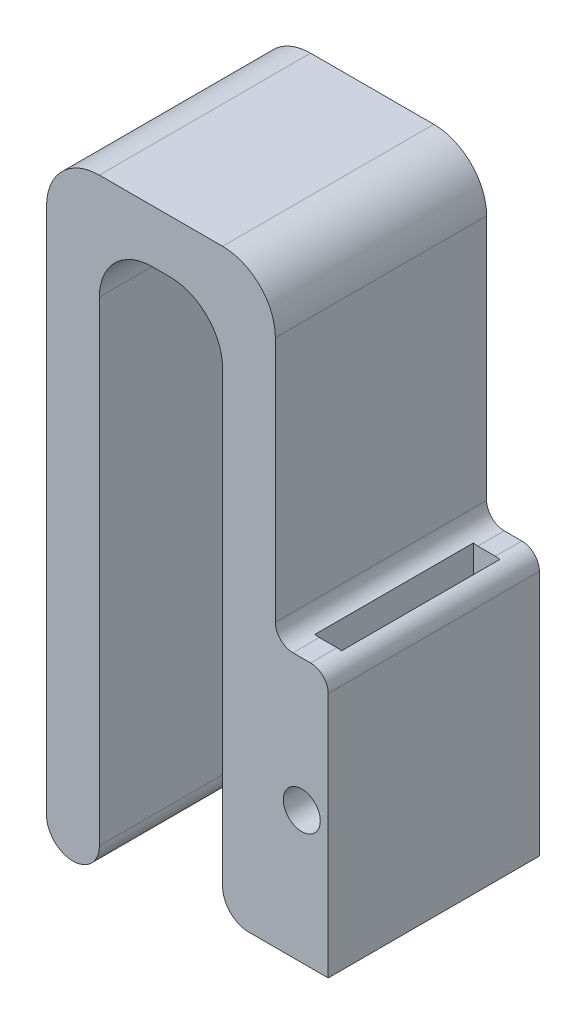
ISO-10303-21;
HEADER;
FILE_DESCRIPTION(('STEP AP214'),'2;1');
FILE_NAME('part.step','',(''),(''),'','','');
FILE_SCHEMA(('AUTOMOTIVE_DESIGN { 1 0 10303 214 1 1 1 1 }'));
ENDSEC;
DATA;
#1=APPLICATION_CONTEXT('core data for automotive mechanical design processes');
#2=APPLICATION_PROTOCOL_DEFINITION('international standard','automotive_design',2000,#1);
#3=PRODUCT_CONTEXT('',#1,'mechanical');
#4=PRODUCT('Part','Part','',(#3));
#5=PRODUCT_RELATED_PRODUCT_CATEGORY('part','',(#4));
#6=PRODUCT_DEFINITION_FORMATION('','',#4);
#7=PRODUCT_DEFINITION_CONTEXT('part definition',#1,'design');
#8=PRODUCT_DEFINITION('design','',#6,#7);
#9=PRODUCT_DEFINITION_SHAPE('','',#8);
#10=(LENGTH_UNIT() NAMED_UNIT(*) SI_UNIT(.MILLI.,.METRE.));
#11=(NAMED_UNIT(*) PLANE_ANGLE_UNIT() SI_UNIT($,.RADIAN.));
#12=(NAMED_UNIT(*) SI_UNIT($,.STERADIAN.) SOLID_ANGLE_UNIT());
#13=UNCERTAINTY_MEASURE_WITH_UNIT(LENGTH_MEASURE(1.E-05),#10,'distance_accuracy_value','');
#14=(GEOMETRIC_REPRESENTATION_CONTEXT(3) GLOBAL_UNCERTAINTY_ASSIGNED_CONTEXT((#13)) GLOBAL_UNIT_ASSIGNED_CONTEXT((#10,
#11,#12)) REPRESENTATION_CONTEXT('',''));
#15=CARTESIAN_POINT('',(0.,0.,0.));
#16=DIRECTION('',(0.,0.,1.));
#17=DIRECTION('',(1.,0.,0.));
#18=AXIS2_PLACEMENT_3D('',#15,#16,#17);
#19=CARTESIAN_POINT('',(0.,15.,12.));
#20=DIRECTION('',(0.,1.,0.));
#21=DIRECTION('',(0.,0.,1.));
#22=AXIS2_PLACEMENT_3D('',#19,#20,#21);
#23=PLANE('',#22);
#24=DIRECTION('',(1.,0.,0.));
#25=VECTOR('',#24,1.);
#26=CARTESIAN_POINT('',(0.,15.,12.));
#27=LINE('',#26,#25);
#28=CARTESIAN_POINT('',(4.,15.,12.));
#29=VERTEX_POINT('',#28);
#30=CARTESIAN_POINT('',(5.,15.,12.));
#31=VERTEX_POINT('',#30);
#32=EDGE_CURVE('E314',#29,#31,#27,.T.);
#33=ORIENTED_EDGE('',*,*,#32,.T.);
#34=DIRECTION('',(0.,0.,-1.));
#35=VECTOR('',#34,1.);
#36=CARTESIAN_POINT('',(5.,15.,0.));
#37=LINE('',#36,#35);
#38=CARTESIAN_POINT('',(5.,15.,10.5));
#39=VERTEX_POINT('',#38);
#40=EDGE_CURVE('E443',#31,#39,#37,.T.);
#41=ORIENTED_EDGE('',*,*,#40,.T.);
#42=DIRECTION('',(1.,0.,0.));
#43=VECTOR('',#42,1.);
#44=CARTESIAN_POINT('',(3.75,15.,10.5));
#45=LINE('',#44,#43);
#46=CARTESIAN_POINT('',(4.,15.,10.5));
#47=VERTEX_POINT('',#46);
#48=EDGE_CURVE('E263',#47,#39,#45,.T.);
#49=ORIENTED_EDGE('',*,*,#48,.F.);
#50=DIRECTION('',(0.,0.,-1.));
#51=VECTOR('',#50,1.);
#52=CARTESIAN_POINT('',(4.,15.,12.));
#53=LINE('',#52,#51);
#54=EDGE_CURVE('E434',#47,#29,#53,.F.);
#55=ORIENTED_EDGE('',*,*,#54,.T.);
#56=EDGE_LOOP('',(#33,#41,#49,#55));
#57=FACE_BOUND('',#56,.T.);
#58=ADVANCED_FACE('F45',(#57),#23,.T.);
#59=CARTESIAN_POINT('',(5.25,-1.5,1.5));
#60=DIRECTION('',(1.,0.,0.));
#61=DIRECTION('',(0.,0.,-1.));
#62=AXIS2_PLACEMENT_3D('',#59,#60,#61);
#63=PLANE('',#62);
#64=DIRECTION('',(0.,1.,0.));
#65=VECTOR('',#64,1.);
#66=CARTESIAN_POINT('',(5.25,-1.5,10.5));
#67=LINE('',#66,#65);
#68=CARTESIAN_POINT('',(5.25,8.23484692283495,10.5));
#69=VERTEX_POINT('',#68);
#70=CARTESIAN_POINT('',(5.25,14.9682458365519,10.5));
#71=VERTEX_POINT('',#70);
#72=EDGE_CURVE('E563',#69,#71,#67,.T.);
#73=ORIENTED_EDGE('',*,*,#72,.T.);
#74=DIRECTION('',(0.,0.,1.));
#75=VECTOR('',#74,1.);
#76=CARTESIAN_POINT('',(5.25,14.9682458365519,10.5));
#77=LINE('',#76,#75);
#78=CARTESIAN_POINT('',(5.25,14.9682458365519,1.5));
#79=VERTEX_POINT('',#78);
#80=EDGE_CURVE('E450',#71,#79,#77,.F.);
#81=ORIENTED_EDGE('',*,*,#80,.T.);
#82=DIRECTION('',(0.,1.,0.));
#83=VECTOR('',#82,1.);
#84=CARTESIAN_POINT('',(5.25,-1.5,1.5));
#85=LINE('',#84,#83);
#86=CARTESIAN_POINT('',(5.25,8.23484692283496,1.5));
#87=VERTEX_POINT('',#86);
#88=EDGE_CURVE('E256',#87,#79,#85,.T.);
#89=ORIENTED_EDGE('',*,*,#88,.F.);
#90=DIRECTION('',(0.,0.,1.));
#91=VECTOR('',#90,1.);
#92=CARTESIAN_POINT('',(5.25,8.23484692283496,0.));
#93=LINE('',#92,#91);
#94=EDGE_CURVE('E568',#87,#69,#93,.T.);
#95=ORIENTED_EDGE('',*,*,#94,.T.);
#96=EDGE_LOOP('',(#73,#81,#89,#95));
#97=FACE_BOUND('',#96,.T.);
#98=ADVANCED_FACE('F566',(#97),#63,.F.);
#99=CARTESIAN_POINT('',(3.75,-1.5,10.5));
#100=DIRECTION('',(0.,0.,1.));
#101=DIRECTION('',(1.,0.,0.));
#102=AXIS2_PLACEMENT_3D('',#99,#100,#101);
#103=PLANE('',#102);
#104=ORIENTED_EDGE('',*,*,#48,.T.);
#105=CARTESIAN_POINT('',(5.,14.,10.5));
#106=DIRECTION('',(0.,0.,1.));
#107=DIRECTION('',(1.,0.,0.));
#108=AXIS2_PLACEMENT_3D('',#105,#106,#107);
#109=CIRCLE('',#108,1.);
#110=EDGE_CURVE('E447',#39,#71,#109,.F.);
#111=ORIENTED_EDGE('',*,*,#110,.T.);
#112=ORIENTED_EDGE('',*,*,#72,.F.);
#113=CARTESIAN_POINT('',(4.5,7.5,10.5));
#114=DIRECTION('',(0.,0.,1.));
#115=DIRECTION('',(1.,0.,0.));
#116=AXIS2_PLACEMENT_3D('',#113,#114,#115);
#117=CIRCLE('',#116,1.05);
#118=CARTESIAN_POINT('',(3.75,8.23484692283495,10.5));
#119=VERTEX_POINT('',#118);
#120=EDGE_CURVE('E581',#69,#119,#117,.T.);
#121=ORIENTED_EDGE('',*,*,#120,.T.);
#122=DIRECTION('',(0.,1.,0.));
#123=VECTOR('',#122,1.);
#124=CARTESIAN_POINT('',(3.75,-1.5,10.5));
#125=LINE('',#124,#123);
#126=CARTESIAN_POINT('',(3.75,15.0317541634481,10.5));
#127=VERTEX_POINT('',#126);
#128=EDGE_CURVE('E61',#119,#127,#125,.T.);
#129=ORIENTED_EDGE('',*,*,#128,.T.);
#130=CARTESIAN_POINT('',(4.,16.,10.5));
#131=DIRECTION('',(0.,0.,1.));
#132=DIRECTION('',(1.,0.,0.));
#133=AXIS2_PLACEMENT_3D('',#130,#131,#132);
#134=CIRCLE('',#133,1.);
#135=EDGE_CURVE('E54',#127,#47,#134,.T.);
#136=ORIENTED_EDGE('',*,*,#135,.T.);
#137=EDGE_LOOP('',(#104,#111,#112,#121,#129,#136));
#138=FACE_BOUND('',#137,.T.);
#139=ADVANCED_FACE('F481',(#138),#103,.F.);
#140=CARTESIAN_POINT('',(3.75,-1.5,1.5));
#141=DIRECTION('',(-1.,0.,0.));
#142=DIRECTION('',(0.,0.,1.));
#143=AXIS2_PLACEMENT_3D('',#140,#141,#142);
#144=PLANE('',#143);
#145=DIRECTION('',(0.,1.,0.));
#146=VECTOR('',#145,1.);
#147=CARTESIAN_POINT('',(3.75,-1.5,1.5));
#148=LINE('',#147,#146);
#149=CARTESIAN_POINT('',(3.75,0.,1.5));
#150=VERTEX_POINT('',#149);
#151=CARTESIAN_POINT('',(3.75,6.76515307716505,1.5));
#152=VERTEX_POINT('',#151);
#153=EDGE_CURVE('E260',#150,#152,#148,.T.);
#154=ORIENTED_EDGE('',*,*,#153,.T.);
#155=DIRECTION('',(0.,0.,1.));
#156=VECTOR('',#155,1.);
#157=CARTESIAN_POINT('',(3.75,6.76515307716505,0.));
#158=LINE('',#157,#156);
#159=CARTESIAN_POINT('',(3.75,6.76515307716505,10.5));
#160=VERTEX_POINT('',#159);
#161=EDGE_CURVE('E232',#152,#160,#158,.T.);
#162=ORIENTED_EDGE('',*,*,#161,.T.);
#163=CARTESIAN_POINT('',(3.75,0.,10.5));
#164=VERTEX_POINT('',#163);
#165=EDGE_CURVE('E570',#164,#160,#125,.T.);
#166=ORIENTED_EDGE('',*,*,#165,.F.);
#167=DIRECTION('',(0.,0.,1.));
#168=VECTOR('',#167,1.);
#169=CARTESIAN_POINT('',(3.75,0.,12.));
#170=LINE('',#169,#168);
#171=EDGE_CURVE('E268',#150,#164,#170,.T.);
#172=ORIENTED_EDGE('',*,*,#171,.F.);
#173=EDGE_LOOP('',(#154,#162,#166,#172));
#174=FACE_BOUND('',#173,.T.);
#175=ADVANCED_FACE('F641',(#174),#144,.F.);
#176=CARTESIAN_POINT('',(3.75,-1.5,1.5));
#177=DIRECTION('',(0.,0.,-1.));
#178=DIRECTION('',(-1.,0.,0.));
#179=AXIS2_PLACEMENT_3D('',#176,#177,#178);
#180=PLANE('',#179);
#181=ORIENTED_EDGE('',*,*,#88,.T.);
#182=CARTESIAN_POINT('',(5.,14.,1.5));
#183=DIRECTION('',(0.,0.,-1.));
#184=DIRECTION('',(-1.,0.,0.));
#185=AXIS2_PLACEMENT_3D('',#182,#183,#184);
#186=CIRCLE('',#185,1.);
#187=CARTESIAN_POINT('',(5.,15.,1.5));
#188=VERTEX_POINT('',#187);
#189=EDGE_CURVE('E453',#79,#188,#186,.F.);
#190=ORIENTED_EDGE('',*,*,#189,.T.);
#191=DIRECTION('',(-1.,0.,0.));
#192=VECTOR('',#191,1.);
#193=CARTESIAN_POINT('',(3.75,15.,1.5));
#194=LINE('',#193,#192);
#195=CARTESIAN_POINT('',(4.,15.,1.5));
#196=VERTEX_POINT('',#195);
#197=EDGE_CURVE('E489',#188,#196,#194,.T.);
#198=ORIENTED_EDGE('',*,*,#197,.T.);
#199=CARTESIAN_POINT('',(4.,16.,1.5));
#200=DIRECTION('',(0.,0.,-1.));
#201=DIRECTION('',(-1.,0.,0.));
#202=AXIS2_PLACEMENT_3D('',#199,#200,#201);
#203=CIRCLE('',#202,1.);
#204=CARTESIAN_POINT('',(3.75,15.0317541634481,1.5));
#205=VERTEX_POINT('',#204);
#206=EDGE_CURVE('E472',#196,#205,#203,.T.);
#207=ORIENTED_EDGE('',*,*,#206,.T.);
#208=CARTESIAN_POINT('',(3.75,8.23484692283495,1.5));
#209=VERTEX_POINT('',#208);
#210=EDGE_CURVE('E68',#209,#205,#148,.T.);
#211=ORIENTED_EDGE('',*,*,#210,.F.);
#212=CARTESIAN_POINT('',(4.5,7.5,1.5));
#213=DIRECTION('',(0.,0.,-1.));
#214=DIRECTION('',(-1.,0.,0.));
#215=AXIS2_PLACEMENT_3D('',#212,#213,#214);
#216=CIRCLE('',#215,1.05);
#217=EDGE_CURVE('E237',#209,#87,#216,.T.);
#218=ORIENTED_EDGE('',*,*,#217,.T.);
#219=EDGE_LOOP('',(#181,#190,#198,#207,#211,#218));
#220=FACE_BOUND('',#219,.T.);
#221=ADVANCED_FACE('F633',(#220),#180,.F.);
#222=CARTESIAN_POINT('',(-8.5,0.,12.));
#223=DIRECTION('',(0.,0.,-1.));
#224=DIRECTION('',(-1.,0.,0.));
#225=AXIS2_PLACEMENT_3D('',#222,#223,#224);
#226=CYLINDRICAL_SURFACE('',#225,1.5);
#227=CARTESIAN_POINT('',(-8.5,0.,0.));
#228=DIRECTION('',(0.,0.,1.));
#229=DIRECTION('',(1.,0.,0.));
#230=AXIS2_PLACEMENT_3D('',#227,#228,#229);
#231=CIRCLE('',#230,1.5);
#232=CARTESIAN_POINT('',(-10.,0.,0.));
#233=VERTEX_POINT('',#232);
#234=CARTESIAN_POINT('',(-7.,0.,0.));
#235=VERTEX_POINT('',#234);
#236=EDGE_CURVE('E279',#233,#235,#231,.T.);
#237=ORIENTED_EDGE('',*,*,#236,.T.);
#238=DIRECTION('',(0.,0.,-1.));
#239=VECTOR('',#238,1.);
#240=CARTESIAN_POINT('',(-7.,0.,12.));
#241=LINE('',#240,#239);
#242=CARTESIAN_POINT('',(-7.,0.,12.));
#243=VERTEX_POINT('',#242);
#244=EDGE_CURVE('E238',#243,#235,#241,.T.);
#245=ORIENTED_EDGE('',*,*,#244,.F.);
#246=CARTESIAN_POINT('',(-8.5,0.,12.));
#247=DIRECTION('',(0.,0.,1.));
#248=DIRECTION('',(1.,0.,0.));
#249=AXIS2_PLACEMENT_3D('',#246,#247,#248);
#250=CIRCLE('',#249,1.5);
#251=CARTESIAN_POINT('',(-10.,0.,12.));
#252=VERTEX_POINT('',#251);
#253=EDGE_CURVE('E280',#252,#243,#250,.T.);
#254=ORIENTED_EDGE('',*,*,#253,.F.);
#255=DIRECTION('',(0.,0.,-1.));
#256=VECTOR('',#255,1.);
#257=CARTESIAN_POINT('',(-10.,0.,12.));
#258=LINE('',#257,#256);
#259=EDGE_CURVE('E338',#252,#233,#258,.T.);
#260=ORIENTED_EDGE('',*,*,#259,.T.);
#261=EDGE_LOOP('',(#237,#245,#254,#260));
#262=FACE_BOUND('',#261,.T.);
#263=ADVANCED_FACE('F520',(#262),#226,.T.);
#264=CARTESIAN_POINT('',(-7.,0.,12.));
#265=DIRECTION('',(1.,0.,0.));
#266=DIRECTION('',(0.,1.,0.));
#267=AXIS2_PLACEMENT_3D('',#264,#265,#266);
#268=PLANE('',#267);
#269=DIRECTION('',(0.,-1.,0.));
#270=VECTOR('',#269,1.);
#271=CARTESIAN_POINT('',(-7.,0.,0.));
#272=LINE('',#271,#270);
#273=CARTESIAN_POINT('',(-7.,27.,0.));
#274=VERTEX_POINT('',#273);
#275=EDGE_CURVE('E342',#274,#235,#272,.T.);
#276=ORIENTED_EDGE('',*,*,#275,.F.);
#277=DIRECTION('',(0.,0.,-1.));
#278=VECTOR('',#277,1.);
#279=CARTESIAN_POINT('',(-7.,27.,12.));
#280=LINE('',#279,#278);
#281=CARTESIAN_POINT('',(-7.,27.,12.));
#282=VERTEX_POINT('',#281);
#283=EDGE_CURVE('E429',#282,#274,#280,.T.);
#284=ORIENTED_EDGE('',*,*,#283,.F.);
#285=DIRECTION('',(0.,-1.,0.));
#286=VECTOR('',#285,1.);
#287=CARTESIAN_POINT('',(-7.,0.,12.));
#288=LINE('',#287,#286);
#289=EDGE_CURVE('E283',#282,#243,#288,.T.);
#290=ORIENTED_EDGE('',*,*,#289,.T.);
#291=ORIENTED_EDGE('',*,*,#244,.T.);
#292=EDGE_LOOP('',(#276,#284,#290,#291));
#293=FACE_BOUND('',#292,.T.);
#294=ADVANCED_FACE('F794',(#293),#268,.T.);
#295=CARTESIAN_POINT('',(-4.,27.,12.));
#296=DIRECTION('',(0.,0.,-1.));
#297=DIRECTION('',(-1.,0.,0.));
#298=AXIS2_PLACEMENT_3D('',#295,#296,#297);
#299=CYLINDRICAL_SURFACE('',#298,3.);
#300=CARTESIAN_POINT('',(-4.,27.,0.));
#301=DIRECTION('',(0.,0.,1.));
#302=DIRECTION('',(1.,0.,0.));
#303=AXIS2_PLACEMENT_3D('',#300,#301,#302);
#304=CIRCLE('',#303,3.);
#305=CARTESIAN_POINT('',(-4.,30.,0.));
#306=VERTEX_POINT('',#305);
#307=EDGE_CURVE('E346',#306,#274,#304,.T.);
#308=ORIENTED_EDGE('',*,*,#307,.F.);
#309=DIRECTION('',(0.,0.,-1.));
#310=VECTOR('',#309,1.);
#311=CARTESIAN_POINT('',(-4.,30.,12.));
#312=LINE('',#311,#310);
#313=CARTESIAN_POINT('',(-4.,30.,12.));
#314=VERTEX_POINT('',#313);
#315=EDGE_CURVE('E426',#314,#306,#312,.T.);
#316=ORIENTED_EDGE('',*,*,#315,.F.);
#317=CARTESIAN_POINT('',(-4.,27.,12.));
#318=DIRECTION('',(0.,0.,1.));
#319=DIRECTION('',(1.,0.,0.));
#320=AXIS2_PLACEMENT_3D('',#317,#318,#319);
#321=CIRCLE('',#320,3.);
#322=EDGE_CURVE('E288',#314,#282,#321,.T.);
#323=ORIENTED_EDGE('',*,*,#322,.T.);
#324=ORIENTED_EDGE('',*,*,#283,.T.);
#325=EDGE_LOOP('',(#308,#316,#323,#324));
#326=FACE_BOUND('',#325,.T.);
#327=ADVANCED_FACE('F527',(#326),#299,.F.);
#328=CARTESIAN_POINT('',(-1.04083408558611E-13,30.,12.));
#329=DIRECTION('',(0.,-1.,0.));
#330=DIRECTION('',(1.,0.,0.));
#331=AXIS2_PLACEMENT_3D('',#328,#329,#330);
#332=PLANE('',#331);
#333=DIRECTION('',(-1.,0.,0.));
#334=VECTOR('',#333,1.);
#335=CARTESIAN_POINT('',(-1.04083408558611E-13,30.,0.));
#336=LINE('',#335,#334);
#337=CARTESIAN_POINT('',(-3.00000000000002,30.,0.));
#338=VERTEX_POINT('',#337);
#339=EDGE_CURVE('E350',#338,#306,#336,.T.);
#340=ORIENTED_EDGE('',*,*,#339,.F.);
#341=DIRECTION('',(0.,0.,-1.));
#342=VECTOR('',#341,1.);
#343=CARTESIAN_POINT('',(-3.00000000000002,30.,12.));
#344=LINE('',#343,#342);
#345=CARTESIAN_POINT('',(-3.00000000000002,30.,12.));
#346=VERTEX_POINT('',#345);
#347=EDGE_CURVE('E423',#346,#338,#344,.T.);
#348=ORIENTED_EDGE('',*,*,#347,.F.);
#349=DIRECTION('',(-1.,0.,0.));
#350=VECTOR('',#349,1.);
#351=CARTESIAN_POINT('',(-1.04083408558611E-13,30.,12.));
#352=LINE('',#351,#350);
#353=EDGE_CURVE('E292',#346,#314,#352,.T.);
#354=ORIENTED_EDGE('',*,*,#353,.T.);
#355=ORIENTED_EDGE('',*,*,#315,.T.);
#356=EDGE_LOOP('',(#340,#348,#354,#355));
#357=FACE_BOUND('',#356,.T.);
#358=ADVANCED_FACE('F531',(#357),#332,.T.);
#359=CARTESIAN_POINT('',(-3.,27.,12.));
#360=DIRECTION('',(0.,0.,-1.));
#361=DIRECTION('',(-1.,0.,0.));
#362=AXIS2_PLACEMENT_3D('',#359,#360,#361);
#363=CYLINDRICAL_SURFACE('',#362,3.);
#364=CARTESIAN_POINT('',(-3.,27.,0.));
#365=DIRECTION('',(0.,0.,1.));
#366=DIRECTION('',(1.,0.,0.));
#367=AXIS2_PLACEMENT_3D('',#364,#365,#366);
#368=CIRCLE('',#367,3.);
#369=CARTESIAN_POINT('',(0.,27.,0.));
#370=VERTEX_POINT('',#369);
#371=EDGE_CURVE('E354',#370,#338,#368,.T.);
#372=ORIENTED_EDGE('',*,*,#371,.F.);
#373=DIRECTION('',(0.,0.,-1.));
#374=VECTOR('',#373,1.);
#375=CARTESIAN_POINT('',(0.,27.,12.));
#376=LINE('',#375,#374);
#377=CARTESIAN_POINT('',(0.,27.,12.));
#378=VERTEX_POINT('',#377);
#379=EDGE_CURVE('E420',#378,#370,#376,.T.);
#380=ORIENTED_EDGE('',*,*,#379,.F.);
#381=CARTESIAN_POINT('',(-3.,27.,12.));
#382=DIRECTION('',(0.,0.,1.));
#383=DIRECTION('',(1.,0.,0.));
#384=AXIS2_PLACEMENT_3D('',#381,#382,#383);
#385=CIRCLE('',#384,3.);
#386=EDGE_CURVE('E296',#378,#346,#385,.T.);
#387=ORIENTED_EDGE('',*,*,#386,.T.);
#388=ORIENTED_EDGE('',*,*,#347,.T.);
#389=EDGE_LOOP('',(#372,#380,#387,#388));
#390=FACE_BOUND('',#389,.T.);
#391=ADVANCED_FACE('F536',(#390),#363,.F.);
#392=CARTESIAN_POINT('',(0.,0.,12.));
#393=DIRECTION('',(-1.,0.,0.));
#394=DIRECTION('',(0.,0.,1.));
#395=AXIS2_PLACEMENT_3D('',#392,#393,#394);
#396=PLANE('',#395);
#397=DIRECTION('',(0.,1.,0.));
#398=VECTOR('',#397,1.);
#399=CARTESIAN_POINT('',(0.,0.,0.));
#400=LINE('',#399,#398);
#401=CARTESIAN_POINT('',(0.,1.5,0.));
#402=VERTEX_POINT('',#401);
#403=EDGE_CURVE('E358',#402,#370,#400,.T.);
#404=ORIENTED_EDGE('',*,*,#403,.F.);
#405=DIRECTION('',(0.,0.,-1.));
#406=VECTOR('',#405,1.);
#407=CARTESIAN_POINT('',(0.,1.5,12.));
#408=LINE('',#407,#406);
#409=CARTESIAN_POINT('',(0.,1.5,12.));
#410=VERTEX_POINT('',#409);
#411=EDGE_CURVE('E417',#410,#402,#408,.T.);
#412=ORIENTED_EDGE('',*,*,#411,.F.);
#413=DIRECTION('',(0.,1.,0.));
#414=VECTOR('',#413,1.);
#415=CARTESIAN_POINT('',(0.,0.,12.));
#416=LINE('',#415,#414);
#417=EDGE_CURVE('E300',#410,#378,#416,.T.);
#418=ORIENTED_EDGE('',*,*,#417,.T.);
#419=ORIENTED_EDGE('',*,*,#379,.T.);
#420=EDGE_LOOP('',(#404,#412,#418,#419));
#421=FACE_BOUND('',#420,.T.);
#422=ADVANCED_FACE('F539',(#421),#396,.T.);
#423=CARTESIAN_POINT('',(1.5,1.5,12.));
#424=DIRECTION('',(0.,0.,-1.));
#425=DIRECTION('',(-1.,0.,0.));
#426=AXIS2_PLACEMENT_3D('',#423,#424,#425);
#427=CYLINDRICAL_SURFACE('',#426,1.5);
#428=CARTESIAN_POINT('',(1.5,1.5,0.));
#429=DIRECTION('',(0.,0.,1.));
#430=DIRECTION('',(1.,0.,0.));
#431=AXIS2_PLACEMENT_3D('',#428,#429,#430);
#432=CIRCLE('',#431,1.5);
#433=CARTESIAN_POINT('',(1.5,0.,0.));
#434=VERTEX_POINT('',#433);
#435=EDGE_CURVE('E362',#402,#434,#432,.T.);
#436=ORIENTED_EDGE('',*,*,#435,.T.);
#437=DIRECTION('',(0.,0.,-1.));
#438=VECTOR('',#437,1.);
#439=CARTESIAN_POINT('',(1.5,0.,12.));
#440=LINE('',#439,#438);
#441=CARTESIAN_POINT('',(1.5,0.,12.));
#442=VERTEX_POINT('',#441);
#443=EDGE_CURVE('E413',#442,#434,#440,.T.);
#444=ORIENTED_EDGE('',*,*,#443,.F.);
#445=CARTESIAN_POINT('',(1.5,1.5,12.));
#446=DIRECTION('',(0.,0.,1.));
#447=DIRECTION('',(1.,0.,0.));
#448=AXIS2_PLACEMENT_3D('',#445,#446,#447);
#449=CIRCLE('',#448,1.5);
#450=EDGE_CURVE('E304',#410,#442,#449,.T.);
#451=ORIENTED_EDGE('',*,*,#450,.F.);
#452=ORIENTED_EDGE('',*,*,#411,.T.);
#453=EDGE_LOOP('',(#436,#444,#451,#452));
#454=FACE_BOUND('',#453,.T.);
#455=ADVANCED_FACE('F545',(#454),#427,.T.);
#456=CARTESIAN_POINT('',(0.,0.,12.));
#457=DIRECTION('',(0.,1.,0.));
#458=DIRECTION('',(-1.,0.,0.));
#459=AXIS2_PLACEMENT_3D('',#456,#457,#458);
#460=PLANE('',#459);
#461=DIRECTION('',(1.,0.,0.));
#462=VECTOR('',#461,1.);
#463=CARTESIAN_POINT('',(0.,0.,10.5));
#464=LINE('',#463,#462);
#465=CARTESIAN_POINT('',(5.25,0.,10.5));
#466=VERTEX_POINT('',#465);
#467=EDGE_CURVE('E272',#164,#466,#464,.T.);
#468=ORIENTED_EDGE('',*,*,#467,.T.);
#469=DIRECTION('',(0.,0.,-1.));
#470=VECTOR('',#469,1.);
#471=CARTESIAN_POINT('',(5.25,0.,12.));
#472=LINE('',#471,#470);
#473=CARTESIAN_POINT('',(5.25,0.,1.5));
#474=VERTEX_POINT('',#473);
#475=EDGE_CURVE('E276',#466,#474,#472,.T.);
#476=ORIENTED_EDGE('',*,*,#475,.T.);
#477=DIRECTION('',(-1.,0.,0.));
#478=VECTOR('',#477,1.);
#479=CARTESIAN_POINT('',(0.,0.,1.5));
#480=LINE('',#479,#478);
#481=EDGE_CURVE('E254',#474,#150,#480,.T.);
#482=ORIENTED_EDGE('',*,*,#481,.T.);
#483=ORIENTED_EDGE('',*,*,#171,.T.);
#484=EDGE_LOOP('',(#468,#476,#482,#483));
#485=FACE_BOUND('',#484,.T.);
#486=DIRECTION('',(1.,0.,0.));
#487=VECTOR('',#486,1.);
#488=CARTESIAN_POINT('',(0.,0.,0.));
#489=LINE('',#488,#487);
#490=CARTESIAN_POINT('',(6.,0.,0.));
#491=VERTEX_POINT('',#490);
#492=EDGE_CURVE('E365',#434,#491,#489,.T.);
#493=ORIENTED_EDGE('',*,*,#492,.T.);
#494=DIRECTION('',(0.,0.,-1.));
#495=VECTOR('',#494,1.);
#496=CARTESIAN_POINT('',(6.,0.,12.));
#497=LINE('',#496,#495);
#498=CARTESIAN_POINT('',(6.,0.,12.));
#499=VERTEX_POINT('',#498);
#500=EDGE_CURVE('E409',#499,#491,#497,.T.);
#501=ORIENTED_EDGE('',*,*,#500,.F.);
#502=DIRECTION('',(1.,0.,0.));
#503=VECTOR('',#502,1.);
#504=CARTESIAN_POINT('',(0.,0.,12.));
#505=LINE('',#504,#503);
#506=EDGE_CURVE('E307',#442,#499,#505,.T.);
#507=ORIENTED_EDGE('',*,*,#506,.F.);
#508=ORIENTED_EDGE('',*,*,#443,.T.);
#509=EDGE_LOOP('',(#493,#501,#507,#508));
#510=FACE_BOUND('',#509,.T.);
#511=ADVANCED_FACE('F549',(#485,#510),#460,.F.);
#512=CARTESIAN_POINT('',(6.,0.,12.));
#513=DIRECTION('',(-1.,0.,0.));
#514=DIRECTION('',(0.,0.,1.));
#515=AXIS2_PLACEMENT_3D('',#512,#513,#514);
#516=PLANE('',#515);
#517=DIRECTION('',(0.,1.,0.));
#518=VECTOR('',#517,1.);
#519=CARTESIAN_POINT('',(6.,0.,0.));
#520=LINE('',#519,#518);
#521=CARTESIAN_POINT('',(6.,14.,0.));
#522=VERTEX_POINT('',#521);
#523=EDGE_CURVE('E368',#491,#522,#520,.T.);
#524=ORIENTED_EDGE('',*,*,#523,.T.);
#525=DIRECTION('',(0.,0.,-1.));
#526=VECTOR('',#525,1.);
#527=CARTESIAN_POINT('',(6.,14.,12.));
#528=LINE('',#527,#526);
#529=CARTESIAN_POINT('',(6.,14.,12.));
#530=VERTEX_POINT('',#529);
#531=EDGE_CURVE('E459',#522,#530,#528,.F.);
#532=ORIENTED_EDGE('',*,*,#531,.T.);
#533=DIRECTION('',(0.,1.,0.));
#534=VECTOR('',#533,1.);
#535=CARTESIAN_POINT('',(6.,0.,12.));
#536=LINE('',#535,#534);
#537=EDGE_CURVE('E310',#499,#530,#536,.T.);
#538=ORIENTED_EDGE('',*,*,#537,.F.);
#539=ORIENTED_EDGE('',*,*,#500,.T.);
#540=EDGE_LOOP('',(#524,#532,#538,#539));
#541=FACE_BOUND('',#540,.T.);
#542=ADVANCED_FACE('F553',(#541),#516,.F.);
#543=ORIENTED_EDGE('',*,*,#197,.F.);
#544=DIRECTION('',(0.,0.,-1.));
#545=VECTOR('',#544,1.);
#546=CARTESIAN_POINT('',(5.,15.,0.));
#547=LINE('',#546,#545);
#548=CARTESIAN_POINT('',(5.,15.,0.));
#549=VERTEX_POINT('',#548);
#550=EDGE_CURVE('E440',#188,#549,#547,.T.);
#551=ORIENTED_EDGE('',*,*,#550,.T.);
#552=DIRECTION('',(1.,0.,0.));
#553=VECTOR('',#552,1.);
#554=CARTESIAN_POINT('',(0.,15.,0.));
#555=LINE('',#554,#553);
#556=CARTESIAN_POINT('',(4.,15.,0.));
#557=VERTEX_POINT('',#556);
#558=EDGE_CURVE('E372',#557,#549,#555,.T.);
#559=ORIENTED_EDGE('',*,*,#558,.F.);
#560=DIRECTION('',(0.,0.,-1.));
#561=VECTOR('',#560,1.);
#562=CARTESIAN_POINT('',(4.,15.,12.));
#563=LINE('',#562,#561);
#564=EDGE_CURVE('E437',#557,#196,#563,.F.);
#565=ORIENTED_EDGE('',*,*,#564,.T.);
#566=EDGE_LOOP('',(#543,#551,#559,#565));
#567=FACE_BOUND('',#566,.T.);
#568=ADVANCED_FACE('F616',(#567),#23,.T.);
#569=CARTESIAN_POINT('',(3.,0.,12.));
#570=DIRECTION('',(1.,0.,0.));
#571=DIRECTION('',(0.,1.,0.));
#572=AXIS2_PLACEMENT_3D('',#569,#570,#571);
#573=PLANE('',#572);
#574=DIRECTION('',(0.,-1.,0.));
#575=VECTOR('',#574,1.);
#576=CARTESIAN_POINT('',(3.,0.,12.));
#577=LINE('',#576,#575);
#578=CARTESIAN_POINT('',(3.,30.,12.));
#579=VERTEX_POINT('',#578);
#580=CARTESIAN_POINT('',(3.,16.,12.));
#581=VERTEX_POINT('',#580);
#582=EDGE_CURVE('E318',#579,#581,#577,.T.);
#583=ORIENTED_EDGE('',*,*,#582,.T.);
#584=DIRECTION('',(0.,0.,-1.));
#585=VECTOR('',#584,1.);
#586=CARTESIAN_POINT('',(3.,16.,0.));
#587=LINE('',#586,#585);
#588=CARTESIAN_POINT('',(3.,16.,0.));
#589=VERTEX_POINT('',#588);
#590=EDGE_CURVE('E465',#581,#589,#587,.T.);
#591=ORIENTED_EDGE('',*,*,#590,.T.);
#592=DIRECTION('',(0.,-1.,0.));
#593=VECTOR('',#592,1.);
#594=CARTESIAN_POINT('',(3.,0.,0.));
#595=LINE('',#594,#593);
#596=CARTESIAN_POINT('',(3.,30.,0.));
#597=VERTEX_POINT('',#596);
#598=EDGE_CURVE('E376',#597,#589,#595,.T.);
#599=ORIENTED_EDGE('',*,*,#598,.F.);
#600=DIRECTION('',(0.,0.,-1.));
#601=VECTOR('',#600,1.);
#602=CARTESIAN_POINT('',(3.,30.,12.));
#603=LINE('',#602,#601);
#604=EDGE_CURVE('E406',#579,#597,#603,.T.);
#605=ORIENTED_EDGE('',*,*,#604,.F.);
#606=EDGE_LOOP('',(#583,#591,#599,#605));
#607=FACE_BOUND('',#606,.T.);
#608=ADVANCED_FACE('F499',(#607),#573,.T.);
#609=CARTESIAN_POINT('',(0.,30.,12.));
#610=DIRECTION('',(0.,0.,-1.));
#611=DIRECTION('',(-1.,0.,0.));
#612=AXIS2_PLACEMENT_3D('',#609,#610,#611);
#613=CYLINDRICAL_SURFACE('',#612,3.);
#614=CARTESIAN_POINT('',(0.,30.,0.));
#615=DIRECTION('',(0.,0.,1.));
#616=DIRECTION('',(1.,0.,0.));
#617=AXIS2_PLACEMENT_3D('',#614,#615,#616);
#618=CIRCLE('',#617,3.);
#619=CARTESIAN_POINT('',(0.,33.,0.));
#620=VERTEX_POINT('',#619);
#621=EDGE_CURVE('E380',#620,#597,#618,.F.);
#622=ORIENTED_EDGE('',*,*,#621,.F.);
#623=DIRECTION('',(0.,0.,-1.));
#624=VECTOR('',#623,1.);
#625=CARTESIAN_POINT('',(0.,33.,12.));
#626=LINE('',#625,#624);
#627=CARTESIAN_POINT('',(0.,33.,12.));
#628=VERTEX_POINT('',#627);
#629=EDGE_CURVE('E403',#628,#620,#626,.T.);
#630=ORIENTED_EDGE('',*,*,#629,.F.);
#631=CARTESIAN_POINT('',(0.,30.,12.));
#632=DIRECTION('',(0.,0.,1.));
#633=DIRECTION('',(1.,0.,0.));
#634=AXIS2_PLACEMENT_3D('',#631,#632,#633);
#635=CIRCLE('',#634,3.);
#636=EDGE_CURVE('E322',#628,#579,#635,.F.);
#637=ORIENTED_EDGE('',*,*,#636,.T.);
#638=ORIENTED_EDGE('',*,*,#604,.T.);
#639=EDGE_LOOP('',(#622,#630,#637,#638));
#640=FACE_BOUND('',#639,.T.);
#641=ADVANCED_FACE('F503',(#640),#613,.T.);
#642=CARTESIAN_POINT('',(0.,33.,12.));
#643=DIRECTION('',(0.,1.,0.));
#644=DIRECTION('',(0.,0.,1.));
#645=AXIS2_PLACEMENT_3D('',#642,#643,#644);
#646=PLANE('',#645);
#647=DIRECTION('',(1.,0.,0.));
#648=VECTOR('',#647,1.);
#649=CARTESIAN_POINT('',(0.,33.,0.));
#650=LINE('',#649,#648);
#651=CARTESIAN_POINT('',(-7.,33.,0.));
#652=VERTEX_POINT('',#651);
#653=EDGE_CURVE('E384',#652,#620,#650,.T.);
#654=ORIENTED_EDGE('',*,*,#653,.F.);
#655=DIRECTION('',(0.,0.,-1.));
#656=VECTOR('',#655,1.);
#657=CARTESIAN_POINT('',(-7.,33.,12.));
#658=LINE('',#657,#656);
#659=CARTESIAN_POINT('',(-7.,33.,12.));
#660=VERTEX_POINT('',#659);
#661=EDGE_CURVE('E400',#660,#652,#658,.T.);
#662=ORIENTED_EDGE('',*,*,#661,.F.);
#663=DIRECTION('',(1.,0.,0.));
#664=VECTOR('',#663,1.);
#665=CARTESIAN_POINT('',(0.,33.,12.));
#666=LINE('',#665,#664);
#667=EDGE_CURVE('E326',#660,#628,#666,.T.);
#668=ORIENTED_EDGE('',*,*,#667,.T.);
#669=ORIENTED_EDGE('',*,*,#629,.T.);
#670=EDGE_LOOP('',(#654,#662,#668,#669));
#671=FACE_BOUND('',#670,.T.);
#672=ADVANCED_FACE('F508',(#671),#646,.T.);
#673=CARTESIAN_POINT('',(-7.,30.,12.));
#674=DIRECTION('',(0.,0.,-1.));
#675=DIRECTION('',(-1.,0.,0.));
#676=AXIS2_PLACEMENT_3D('',#673,#674,#675);
#677=CYLINDRICAL_SURFACE('',#676,3.);
#678=CARTESIAN_POINT('',(-7.,30.,0.));
#679=DIRECTION('',(0.,0.,1.));
#680=DIRECTION('',(1.,0.,0.));
#681=AXIS2_PLACEMENT_3D('',#678,#679,#680);
#682=CIRCLE('',#681,3.);
#683=CARTESIAN_POINT('',(-10.,30.,0.));
#684=VERTEX_POINT('',#683);
#685=EDGE_CURVE('E388',#684,#652,#682,.F.);
#686=ORIENTED_EDGE('',*,*,#685,.F.);
#687=DIRECTION('',(0.,0.,-1.));
#688=VECTOR('',#687,1.);
#689=CARTESIAN_POINT('',(-10.,30.,12.));
#690=LINE('',#689,#688);
#691=CARTESIAN_POINT('',(-10.,30.,12.));
#692=VERTEX_POINT('',#691);
#693=EDGE_CURVE('E397',#692,#684,#690,.T.);
#694=ORIENTED_EDGE('',*,*,#693,.F.);
#695=CARTESIAN_POINT('',(-7.,30.,12.));
#696=DIRECTION('',(0.,0.,1.));
#697=DIRECTION('',(1.,0.,0.));
#698=AXIS2_PLACEMENT_3D('',#695,#696,#697);
#699=CIRCLE('',#698,3.);
#700=EDGE_CURVE('E330',#692,#660,#699,.F.);
#701=ORIENTED_EDGE('',*,*,#700,.T.);
#702=ORIENTED_EDGE('',*,*,#661,.T.);
#703=EDGE_LOOP('',(#686,#694,#701,#702));
#704=FACE_BOUND('',#703,.T.);
#705=ADVANCED_FACE('F511',(#704),#677,.T.);
#706=CARTESIAN_POINT('',(-10.,0.,12.));
#707=DIRECTION('',(-1.,0.,0.));
#708=DIRECTION('',(0.,0.,1.));
#709=AXIS2_PLACEMENT_3D('',#706,#707,#708);
#710=PLANE('',#709);
#711=DIRECTION('',(0.,1.,0.));
#712=VECTOR('',#711,1.);
#713=CARTESIAN_POINT('',(-10.,0.,0.));
#714=LINE('',#713,#712);
#715=EDGE_CURVE('E284',#233,#684,#714,.T.);
#716=ORIENTED_EDGE('',*,*,#715,.F.);
#717=ORIENTED_EDGE('',*,*,#259,.F.);
#718=DIRECTION('',(0.,1.,0.));
#719=VECTOR('',#718,1.);
#720=CARTESIAN_POINT('',(-10.,0.,12.));
#721=LINE('',#720,#719);
#722=EDGE_CURVE('E334',#252,#692,#721,.T.);
#723=ORIENTED_EDGE('',*,*,#722,.T.);
#724=ORIENTED_EDGE('',*,*,#693,.T.);
#725=EDGE_LOOP('',(#716,#717,#723,#724));
#726=FACE_BOUND('',#725,.T.);
#727=ADVANCED_FACE('F515',(#726),#710,.T.);
#728=CARTESIAN_POINT('',(0.,0.,12.));
#729=DIRECTION('',(0.,0.,1.));
#730=DIRECTION('',(1.,0.,0.));
#731=AXIS2_PLACEMENT_3D('',#728,#729,#730);
#732=PLANE('',#731);
#733=CARTESIAN_POINT('',(4.5,7.5,12.));
#734=DIRECTION('',(0.,0.,1.));
#735=DIRECTION('',(1.,0.,0.));
#736=AXIS2_PLACEMENT_3D('',#733,#734,#735);
#737=CIRCLE('',#736,1.05);
#738=CARTESIAN_POINT('',(5.55,7.5,12.));
#739=VERTEX_POINT('',#738);
#740=EDGE_CURVE('E589',#739,#739,#737,.T.);
#741=ORIENTED_EDGE('',*,*,#740,.F.);
#742=EDGE_LOOP('',(#741));
#743=FACE_BOUND('',#742,.T.);
#744=ORIENTED_EDGE('',*,*,#537,.T.);
#745=CARTESIAN_POINT('',(5.,14.,12.));
#746=DIRECTION('',(0.,0.,1.));
#747=DIRECTION('',(1.,0.,0.));
#748=AXIS2_PLACEMENT_3D('',#745,#746,#747);
#749=CIRCLE('',#748,1.);
#750=EDGE_CURVE('E462',#530,#31,#749,.T.);
#751=ORIENTED_EDGE('',*,*,#750,.T.);
#752=ORIENTED_EDGE('',*,*,#32,.F.);
#753=CARTESIAN_POINT('',(4.,16.,12.));
#754=DIRECTION('',(0.,0.,1.));
#755=DIRECTION('',(1.,0.,0.));
#756=AXIS2_PLACEMENT_3D('',#753,#754,#755);
#757=CIRCLE('',#756,1.);
#758=EDGE_CURVE('E11',#29,#581,#757,.F.);
#759=ORIENTED_EDGE('',*,*,#758,.T.);
#760=ORIENTED_EDGE('',*,*,#582,.F.);
#761=ORIENTED_EDGE('',*,*,#636,.F.);
#762=ORIENTED_EDGE('',*,*,#667,.F.);
#763=ORIENTED_EDGE('',*,*,#700,.F.);
#764=ORIENTED_EDGE('',*,*,#722,.F.);
#765=ORIENTED_EDGE('',*,*,#253,.T.);
#766=ORIENTED_EDGE('',*,*,#289,.F.);
#767=ORIENTED_EDGE('',*,*,#322,.F.);
#768=ORIENTED_EDGE('',*,*,#353,.F.);
#769=ORIENTED_EDGE('',*,*,#386,.F.);
#770=ORIENTED_EDGE('',*,*,#417,.F.);
#771=ORIENTED_EDGE('',*,*,#450,.T.);
#772=ORIENTED_EDGE('',*,*,#506,.T.);
#773=EDGE_LOOP('',(#744,#751,#752,#759,#760,#761,#762,#763,#764,#765,#766,#767,#768,#769,#770,
#771,#772));
#774=FACE_BOUND('',#773,.T.);
#775=ADVANCED_FACE('F496',(#743,#774),#732,.T.);
#776=CARTESIAN_POINT('',(0.,0.,0.));
#777=DIRECTION('',(0.,0.,1.));
#778=DIRECTION('',(1.,0.,0.));
#779=AXIS2_PLACEMENT_3D('',#776,#777,#778);
#780=PLANE('',#779);
#781=CARTESIAN_POINT('',(4.5,7.5,0.));
#782=DIRECTION('',(0.,0.,1.));
#783=DIRECTION('',(1.,0.,0.));
#784=AXIS2_PLACEMENT_3D('',#781,#782,#783);
#785=CIRCLE('',#784,1.05);
#786=CARTESIAN_POINT('',(5.55,7.5,0.));
#787=VERTEX_POINT('',#786);
#788=EDGE_CURVE('E588',#787,#787,#785,.T.);
#789=ORIENTED_EDGE('',*,*,#788,.T.);
#790=EDGE_LOOP('',(#789));
#791=FACE_BOUND('',#790,.T.);
#792=ORIENTED_EDGE('',*,*,#558,.T.);
#793=CARTESIAN_POINT('',(5.,14.,0.));
#794=DIRECTION('',(0.,0.,1.));
#795=DIRECTION('',(1.,0.,0.));
#796=AXIS2_PLACEMENT_3D('',#793,#794,#795);
#797=CIRCLE('',#796,1.);
#798=EDGE_CURVE('E456',#549,#522,#797,.F.);
#799=ORIENTED_EDGE('',*,*,#798,.T.);
#800=ORIENTED_EDGE('',*,*,#523,.F.);
#801=ORIENTED_EDGE('',*,*,#492,.F.);
#802=ORIENTED_EDGE('',*,*,#435,.F.);
#803=ORIENTED_EDGE('',*,*,#403,.T.);
#804=ORIENTED_EDGE('',*,*,#371,.T.);
#805=ORIENTED_EDGE('',*,*,#339,.T.);
#806=ORIENTED_EDGE('',*,*,#307,.T.);
#807=ORIENTED_EDGE('',*,*,#275,.T.);
#808=ORIENTED_EDGE('',*,*,#236,.F.);
#809=ORIENTED_EDGE('',*,*,#715,.T.);
#810=ORIENTED_EDGE('',*,*,#685,.T.);
#811=ORIENTED_EDGE('',*,*,#653,.T.);
#812=ORIENTED_EDGE('',*,*,#621,.T.);
#813=ORIENTED_EDGE('',*,*,#598,.T.);
#814=CARTESIAN_POINT('',(4.,16.,0.));
#815=DIRECTION('',(0.,0.,1.));
#816=DIRECTION('',(1.,0.,0.));
#817=AXIS2_PLACEMENT_3D('',#814,#815,#816);
#818=CIRCLE('',#817,1.);
#819=EDGE_CURVE('E469',#589,#557,#818,.T.);
#820=ORIENTED_EDGE('',*,*,#819,.T.);
#821=EDGE_LOOP('',(#792,#799,#800,#801,#802,#803,#804,#805,#806,#807,#808,#809,#810,#811,#812,
#813,#820));
#822=FACE_BOUND('',#821,.T.);
#823=ADVANCED_FACE('F597',(#791,#822),#780,.F.);
#824=CARTESIAN_POINT('',(5.25,6.76515307716505,10.5));
#825=VERTEX_POINT('',#824);
#826=EDGE_CURVE('E247',#466,#825,#67,.T.);
#827=ORIENTED_EDGE('',*,*,#826,.T.);
#828=DIRECTION('',(0.,0.,1.));
#829=VECTOR('',#828,1.);
#830=CARTESIAN_POINT('',(5.25,6.76515307716504,0.));
#831=LINE('',#830,#829);
#832=CARTESIAN_POINT('',(5.25,6.76515307716504,1.5));
#833=VERTEX_POINT('',#832);
#834=EDGE_CURVE('E229',#825,#833,#831,.F.);
#835=ORIENTED_EDGE('',*,*,#834,.T.);
#836=EDGE_CURVE('E244',#474,#833,#85,.T.);
#837=ORIENTED_EDGE('',*,*,#836,.F.);
#838=ORIENTED_EDGE('',*,*,#475,.F.);
#839=EDGE_LOOP('',(#827,#835,#837,#838));
#840=FACE_BOUND('',#839,.T.);
#841=ADVANCED_FACE('F243',(#840),#63,.F.);
#842=ORIENTED_EDGE('',*,*,#165,.T.);
#843=EDGE_CURVE('E250',#160,#825,#117,.T.);
#844=ORIENTED_EDGE('',*,*,#843,.T.);
#845=ORIENTED_EDGE('',*,*,#826,.F.);
#846=ORIENTED_EDGE('',*,*,#467,.F.);
#847=EDGE_LOOP('',(#842,#844,#845,#846));
#848=FACE_BOUND('',#847,.T.);
#849=ADVANCED_FACE('F645',(#848),#103,.F.);
#850=ORIENTED_EDGE('',*,*,#128,.F.);
#851=DIRECTION('',(0.,0.,1.));
#852=VECTOR('',#851,1.);
#853=CARTESIAN_POINT('',(3.75,8.23484692283495,0.));
#854=LINE('',#853,#852);
#855=EDGE_CURVE('E249',#119,#209,#854,.F.);
#856=ORIENTED_EDGE('',*,*,#855,.T.);
#857=ORIENTED_EDGE('',*,*,#210,.T.);
#858=DIRECTION('',(0.,0.,1.));
#859=VECTOR('',#858,1.);
#860=CARTESIAN_POINT('',(3.75,15.0317541634481,1.5));
#861=LINE('',#860,#859);
#862=EDGE_CURVE('E475',#205,#127,#861,.T.);
#863=ORIENTED_EDGE('',*,*,#862,.T.);
#864=EDGE_LOOP('',(#850,#856,#857,#863));
#865=FACE_BOUND('',#864,.T.);
#866=ADVANCED_FACE('F636',(#865),#144,.F.);
#867=ORIENTED_EDGE('',*,*,#836,.T.);
#868=EDGE_CURVE('E225',#833,#152,#216,.T.);
#869=ORIENTED_EDGE('',*,*,#868,.T.);
#870=ORIENTED_EDGE('',*,*,#153,.F.);
#871=ORIENTED_EDGE('',*,*,#481,.F.);
#872=EDGE_LOOP('',(#867,#869,#870,#871));
#873=FACE_BOUND('',#872,.T.);
#874=ADVANCED_FACE('F252',(#873),#180,.F.);
#875=CARTESIAN_POINT('',(4.5,7.5,0.));
#876=DIRECTION('',(0.,0.,1.));
#877=DIRECTION('',(1.,0.,0.));
#878=AXIS2_PLACEMENT_3D('',#875,#876,#877);
#879=CYLINDRICAL_SURFACE('',#878,1.05);
#880=ORIENTED_EDGE('',*,*,#788,.F.);
#881=EDGE_LOOP('',(#880));
#882=FACE_BOUND('',#881,.T.);
#883=ORIENTED_EDGE('',*,*,#740,.T.);
#884=EDGE_LOOP('',(#883));
#885=FACE_BOUND('',#884,.T.);
#886=ORIENTED_EDGE('',*,*,#843,.F.);
#887=ORIENTED_EDGE('',*,*,#161,.F.);
#888=ORIENTED_EDGE('',*,*,#868,.F.);
#889=ORIENTED_EDGE('',*,*,#834,.F.);
#890=EDGE_LOOP('',(#886,#887,#888,#889));
#891=FACE_BOUND('',#890,.T.);
#892=ORIENTED_EDGE('',*,*,#217,.F.);
#893=ORIENTED_EDGE('',*,*,#855,.F.);
#894=ORIENTED_EDGE('',*,*,#120,.F.);
#895=ORIENTED_EDGE('',*,*,#94,.F.);
#896=EDGE_LOOP('',(#892,#893,#894,#895));
#897=FACE_BOUND('',#896,.T.);
#898=ADVANCED_FACE('F227',(#882,#885,#891,#897),#879,.F.);
#899=CARTESIAN_POINT('',(5.,14.,12.));
#900=DIRECTION('',(0.,0.,1.));
#901=DIRECTION('',(1.,0.,0.));
#902=AXIS2_PLACEMENT_3D('',#899,#900,#901);
#903=CYLINDRICAL_SURFACE('',#902,1.);
#904=ORIENTED_EDGE('',*,*,#750,.F.);
#905=ORIENTED_EDGE('',*,*,#531,.F.);
#906=ORIENTED_EDGE('',*,*,#798,.F.);
#907=ORIENTED_EDGE('',*,*,#550,.F.);
#908=ORIENTED_EDGE('',*,*,#189,.F.);
#909=ORIENTED_EDGE('',*,*,#80,.F.);
#910=ORIENTED_EDGE('',*,*,#110,.F.);
#911=ORIENTED_EDGE('',*,*,#40,.F.);
#912=EDGE_LOOP('',(#904,#905,#906,#907,#908,#909,#910,#911));
#913=FACE_BOUND('',#912,.T.);
#914=ADVANCED_FACE('F557',(#913),#903,.T.);
#915=CARTESIAN_POINT('',(4.,16.,12.));
#916=DIRECTION('',(0.,0.,1.));
#917=DIRECTION('',(1.,0.,0.));
#918=AXIS2_PLACEMENT_3D('',#915,#916,#917);
#919=CYLINDRICAL_SURFACE('',#918,1.);
#920=ORIENTED_EDGE('',*,*,#206,.F.);
#921=ORIENTED_EDGE('',*,*,#564,.F.);
#922=ORIENTED_EDGE('',*,*,#819,.F.);
#923=ORIENTED_EDGE('',*,*,#590,.F.);
#924=ORIENTED_EDGE('',*,*,#758,.F.);
#925=ORIENTED_EDGE('',*,*,#54,.F.);
#926=ORIENTED_EDGE('',*,*,#135,.F.);
#927=ORIENTED_EDGE('',*,*,#862,.F.);
#928=EDGE_LOOP('',(#920,#921,#922,#923,#924,#925,#926,#927));
#929=FACE_BOUND('',#928,.T.);
#930=ADVANCED_FACE('F47',(#929),#919,.F.);
#931=CLOSED_SHELL('',(#58,#98,#139,#175,#221,#263,#294,#327,#358,#391,#422,#455,#511,#542,#568,
#608,#641,#672,#705,#727,#775,#823,#841,#849,#866,#874,#898,#914,#930));
#932=MANIFOLD_SOLID_BREP('B2',#931);
#933=ADVANCED_BREP_SHAPE_REPRESENTATION('',(#18,#932),#14);
#934=SHAPE_DEFINITION_REPRESENTATION(#9,#933);
ENDSEC;
END-ISO-10303-21;
